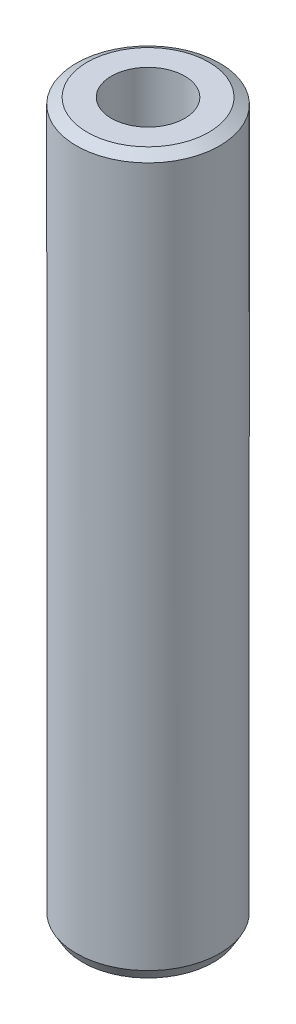
ISO-10303-21;
HEADER;
FILE_DESCRIPTION(('STEP AP214'),'2;1');
FILE_NAME('part.step','',(''),(''),'','','');
FILE_SCHEMA(('AUTOMOTIVE_DESIGN { 1 0 10303 214 1 1 1 1 }'));
ENDSEC;
DATA;
#1=APPLICATION_CONTEXT('core data for automotive mechanical design processes');
#2=APPLICATION_PROTOCOL_DEFINITION('international standard','automotive_design',2000,#1);
#3=PRODUCT_CONTEXT('',#1,'mechanical');
#4=PRODUCT('Part','Part','',(#3));
#5=PRODUCT_RELATED_PRODUCT_CATEGORY('part','',(#4));
#6=PRODUCT_DEFINITION_FORMATION('','',#4);
#7=PRODUCT_DEFINITION_CONTEXT('part definition',#1,'design');
#8=PRODUCT_DEFINITION('design','',#6,#7);
#9=PRODUCT_DEFINITION_SHAPE('','',#8);
#10=(LENGTH_UNIT() NAMED_UNIT(*) SI_UNIT(.MILLI.,.METRE.));
#11=(NAMED_UNIT(*) PLANE_ANGLE_UNIT() SI_UNIT($,.RADIAN.));
#12=(NAMED_UNIT(*) SI_UNIT($,.STERADIAN.) SOLID_ANGLE_UNIT());
#13=UNCERTAINTY_MEASURE_WITH_UNIT(LENGTH_MEASURE(1.E-05),#10,'distance_accuracy_value','');
#14=(GEOMETRIC_REPRESENTATION_CONTEXT(3) GLOBAL_UNCERTAINTY_ASSIGNED_CONTEXT((#13)) GLOBAL_UNIT_ASSIGNED_CONTEXT((#10,
#11,#12)) REPRESENTATION_CONTEXT('',''));
#15=CARTESIAN_POINT('',(0.,0.,0.));
#16=DIRECTION('',(0.,0.,1.));
#17=DIRECTION('',(1.,0.,0.));
#18=AXIS2_PLACEMENT_3D('',#15,#16,#17);
#19=CARTESIAN_POINT('',(0.,600.,0.));
#20=DIRECTION('',(0.,-1.,0.));
#21=DIRECTION('',(0.,0.,-1.));
#22=AXIS2_PLACEMENT_3D('',#19,#20,#21);
#23=CYLINDRICAL_SURFACE('',#22,60.);
#24=CARTESIAN_POINT('',(0.,594.753850427031,0.));
#25=DIRECTION('',(0.,1.,0.));
#26=DIRECTION('',(0.,0.,1.));
#27=AXIS2_PLACEMENT_3D('',#24,#25,#26);
#28=CIRCLE('',#27,60.);
#29=CARTESIAN_POINT('',(0.,594.753850427031,-60.0000000000001));
#30=VERTEX_POINT('',#29);
#31=EDGE_CURVE('E50',#30,#30,#28,.F.);
#32=ORIENTED_EDGE('',*,*,#31,.T.);
#33=EDGE_LOOP('',(#32));
#34=FACE_BOUND('',#33,.T.);
#35=CARTESIAN_POINT('',(0.,9.08659760448893,0.));
#36=DIRECTION('',(0.,1.,0.));
#37=DIRECTION('',(0.,0.,1.));
#38=AXIS2_PLACEMENT_3D('',#35,#36,#37);
#39=CIRCLE('',#38,60.);
#40=CARTESIAN_POINT('',(0.,9.08659760448893,60.));
#41=VERTEX_POINT('',#40);
#42=EDGE_CURVE('E51',#41,#41,#39,.T.);
#43=ORIENTED_EDGE('',*,*,#42,.T.);
#44=EDGE_LOOP('',(#43));
#45=FACE_BOUND('',#44,.T.);
#46=ADVANCED_FACE('F39',(#34,#45),#23,.T.);
#47=CARTESIAN_POINT('',(0.,600.,0.));
#48=DIRECTION('',(0.,1.,0.));
#49=DIRECTION('',(0.,0.,1.));
#50=AXIS2_PLACEMENT_3D('',#47,#48,#49);
#51=PLANE('',#50);
#52=CARTESIAN_POINT('',(0.,600.,0.));
#53=DIRECTION('',(0.,1.,0.));
#54=DIRECTION('',(0.,0.,1.));
#55=AXIS2_PLACEMENT_3D('',#52,#53,#54);
#56=CIRCLE('',#55,50.9134023955113);
#57=CARTESIAN_POINT('',(0.,600.,-50.9134023955114));
#58=VERTEX_POINT('',#57);
#59=EDGE_CURVE('E54',#58,#58,#56,.T.);
#60=ORIENTED_EDGE('',*,*,#59,.T.);
#61=EDGE_LOOP('',(#60));
#62=FACE_BOUND('',#61,.T.);
#63=CARTESIAN_POINT('',(0.,600.,0.));
#64=DIRECTION('',(0.,1.,0.));
#65=DIRECTION('',(0.,0.,1.));
#66=AXIS2_PLACEMENT_3D('',#63,#64,#65);
#67=CIRCLE('',#66,30.6929380186561);
#68=CARTESIAN_POINT('',(0.,600.,30.6929380186561));
#69=VERTEX_POINT('',#68);
#70=EDGE_CURVE('E58',#69,#69,#67,.T.);
#71=ORIENTED_EDGE('',*,*,#70,.F.);
#72=EDGE_LOOP('',(#71));
#73=FACE_BOUND('',#72,.T.);
#74=ADVANCED_FACE('F69',(#62,#73),#51,.T.);
#75=CARTESIAN_POINT('',(0.,0.,0.));
#76=DIRECTION('',(0.,1.,0.));
#77=DIRECTION('',(0.,0.,1.));
#78=AXIS2_PLACEMENT_3D('',#75,#76,#77);
#79=PLANE('',#78);
#80=CARTESIAN_POINT('',(0.,0.,0.));
#81=DIRECTION('',(0.,1.,0.));
#82=DIRECTION('',(0.,0.,1.));
#83=AXIS2_PLACEMENT_3D('',#80,#81,#82);
#84=CIRCLE('',#83,54.7538504270304);
#85=CARTESIAN_POINT('',(0.,0.,54.7538504270304));
#86=VERTEX_POINT('',#85);
#87=EDGE_CURVE('E10',#86,#86,#84,.F.);
#88=ORIENTED_EDGE('',*,*,#87,.T.);
#89=EDGE_LOOP('',(#88));
#90=FACE_BOUND('',#89,.T.);
#91=CARTESIAN_POINT('',(0.,0.,0.));
#92=DIRECTION('',(0.,1.,0.));
#93=DIRECTION('',(0.,0.,1.));
#94=AXIS2_PLACEMENT_3D('',#91,#92,#93);
#95=CIRCLE('',#94,30.6929380186561);
#96=CARTESIAN_POINT('',(0.,0.,30.6929380186561));
#97=VERTEX_POINT('',#96);
#98=EDGE_CURVE('E63',#97,#97,#95,.T.);
#99=ORIENTED_EDGE('',*,*,#98,.T.);
#100=EDGE_LOOP('',(#99));
#101=FACE_BOUND('',#100,.T.);
#102=ADVANCED_FACE('F75',(#90,#101),#79,.F.);
#103=CARTESIAN_POINT('',(0.,600.,0.));
#104=DIRECTION('',(0.,-1.,0.));
#105=DIRECTION('',(0.,0.,-1.));
#106=AXIS2_PLACEMENT_3D('',#103,#104,#105);
#107=CYLINDRICAL_SURFACE('',#106,30.6929380186561);
#108=ORIENTED_EDGE('',*,*,#70,.T.);
#109=EDGE_LOOP('',(#108));
#110=FACE_BOUND('',#109,.T.);
#111=ORIENTED_EDGE('',*,*,#98,.F.);
#112=EDGE_LOOP('',(#111));
#113=FACE_BOUND('',#112,.T.);
#114=ADVANCED_FACE('F70',(#110,#113),#107,.F.);
#115=CARTESIAN_POINT('',(0.,600.,0.));
#116=DIRECTION('',(0.,-1.,0.));
#117=DIRECTION('',(0.,0.,-1.));
#118=AXIS2_PLACEMENT_3D('',#115,#116,#117);
#119=CONICAL_SURFACE('',#118,50.9134023955113,1.04719755119659);
#120=CARTESIAN_POINT('',(0.,594.753850427031,-60.0000000000001));
#121=CARTESIAN_POINT('',(0.,594.808497818416,-59.90534794162));
#122=CARTESIAN_POINT('',(0.,594.863145209801,-59.8106958832399));
#123=CARTESIAN_POINT('',(0.,594.972439992571,-59.6213917664797));
#124=CARTESIAN_POINT('',(0.,595.027087383956,-59.5267397080996));
#125=CARTESIAN_POINT('',(0.,595.136382166726,-59.3374355913395));
#126=CARTESIAN_POINT('',(0.,595.191029558111,-59.2427835329594));
#127=CARTESIAN_POINT('',(0.,595.300324340881,-59.0534794161992));
#128=CARTESIAN_POINT('',(0.,595.354971732267,-58.9588273578191));
#129=CARTESIAN_POINT('',(0.,595.464266515037,-58.7695232410589));
#130=CARTESIAN_POINT('',(0.,595.518913906422,-58.6748711826788));
#131=CARTESIAN_POINT('',(0.,595.628208689192,-58.4855670659186));
#132=CARTESIAN_POINT('',(0.,595.682856080577,-58.3909150075386));
#133=CARTESIAN_POINT('',(0.,595.792150863347,-58.2016108907784));
#134=CARTESIAN_POINT('',(0.,595.846798254733,-58.1069588323983));
#135=CARTESIAN_POINT('',(0.,595.956093037503,-57.9176547156381));
#136=CARTESIAN_POINT('',(0.,596.010740428888,-57.823002657258));
#137=CARTESIAN_POINT('',(0.,596.120035211658,-57.6336985404978));
#138=CARTESIAN_POINT('',(0.,596.174682603043,-57.5390464821178));
#139=CARTESIAN_POINT('',(0.,596.283977385813,-57.3497423653576));
#140=CARTESIAN_POINT('',(0.,596.338624777198,-57.2550903069775));
#141=CARTESIAN_POINT('',(0.,596.447919559969,-57.0657861902173));
#142=CARTESIAN_POINT('',(0.,596.502566951354,-56.9711341318372));
#143=CARTESIAN_POINT('',(0.,596.611861734124,-56.781830015077));
#144=CARTESIAN_POINT('',(0.,596.666509125509,-56.6871779566969));
#145=CARTESIAN_POINT('',(0.,596.775803908279,-56.4978738399368));
#146=CARTESIAN_POINT('',(0.,596.830451299664,-56.4032217815567));
#147=CARTESIAN_POINT('',(0.,596.939746082434,-56.2139176647965));
#148=CARTESIAN_POINT('',(0.,596.99439347382,-56.1192656064164));
#149=CARTESIAN_POINT('',(0.,597.10368825659,-55.9299614896562));
#150=CARTESIAN_POINT('',(0.,597.158335647975,-55.8353094312761));
#151=CARTESIAN_POINT('',(0.,597.267630430745,-55.6460053145159));
#152=CARTESIAN_POINT('',(0.,597.32227782213,-55.5513532561359));
#153=CARTESIAN_POINT('',(0.,597.4315726049,-55.3620491393757));
#154=CARTESIAN_POINT('',(0.,597.486219996286,-55.2673970809956));
#155=CARTESIAN_POINT('',(0.,597.595514779056,-55.0780929642354));
#156=CARTESIAN_POINT('',(0.,597.650162170441,-54.9834409058553));
#157=CARTESIAN_POINT('',(0.,597.759456953211,-54.7941367890951));
#158=CARTESIAN_POINT('',(0.,597.814104344596,-54.699484730715));
#159=CARTESIAN_POINT('',(0.,597.923399127366,-54.5101806139549));
#160=CARTESIAN_POINT('',(0.,597.978046518751,-54.4155285555748));
#161=CARTESIAN_POINT('',(0.,598.087341301521,-54.2262244388146));
#162=CARTESIAN_POINT('',(0.,598.141988692907,-54.1315723804345));
#163=CARTESIAN_POINT('',(0.,598.251283475677,-53.9422682636743));
#164=CARTESIAN_POINT('',(0.,598.305930867062,-53.8476162052942));
#165=CARTESIAN_POINT('',(0.,598.415225649832,-53.6583120885341));
#166=CARTESIAN_POINT('',(0.,598.469873041217,-53.563660030154));
#167=CARTESIAN_POINT('',(0.,598.579167823987,-53.3743559133938));
#168=CARTESIAN_POINT('',(0.,598.633815215372,-53.2797038550137));
#169=CARTESIAN_POINT('',(0.,598.743109998143,-53.0903997382535));
#170=CARTESIAN_POINT('',(0.,598.797757389528,-52.9957476798734));
#171=CARTESIAN_POINT('',(0.,598.907052172298,-52.8064435631132));
#172=CARTESIAN_POINT('',(0.,598.961699563683,-52.7117915047331));
#173=CARTESIAN_POINT('',(0.,599.070994346453,-52.522487387973));
#174=CARTESIAN_POINT('',(0.,599.125641737838,-52.4278353295929));
#175=CARTESIAN_POINT('',(0.,599.234936520609,-52.2385312128327));
#176=CARTESIAN_POINT('',(0.,599.289583911994,-52.1438791544526));
#177=CARTESIAN_POINT('',(0.,599.398878694764,-51.9545750376924));
#178=CARTESIAN_POINT('',(0.,599.453526086149,-51.8599229793123));
#179=CARTESIAN_POINT('',(0.,599.562820868919,-51.6706188625522));
#180=CARTESIAN_POINT('',(0.,599.617468260304,-51.5759668041721));
#181=CARTESIAN_POINT('',(0.,599.726763043074,-51.3866626874119));
#182=CARTESIAN_POINT('',(0.,599.78141043446,-51.2920106290318));
#183=CARTESIAN_POINT('',(0.,599.89070521723,-51.1027065122716));
#184=CARTESIAN_POINT('',(0.,599.945352608615,-51.0080544538915));
#185=CARTESIAN_POINT('',(0.,600.,-50.9134023955114));
#186=B_SPLINE_CURVE_WITH_KNOTS('',3,(#120,#121,#122,#123,#124,#125,#126,#127,#128,#129,#130,
#131,#132,#133,#134,#135,#136,#137,#138,#139,#140,#141,#142,#143,#144,#145,#146,#147,#148,#149,
#150,#151,#152,#153,#154,#155,#156,#157,#158,#159,#160,#161,#162,#163,#164,#165,#166,#167,#168,
#169,#170,#171,#172,#173,#174,#175,#176,#177,#178,#179,#180,#181,#182,#183,#184,#185),
.UNSPECIFIED.,.F.,.F.,(4,2,2,2,2,2,2,2,2,2,2,2,2,2,2,2,2,2,2,2,2,2,2,2,2,2,2,2,2,2,2,2,4),(0.,
0.327884348310576,0.655768696621152,0.983653044931722,1.3115373932423,1.63942174155287,
1.9673060898635,2.29519043817407,2.62307478648465,2.95095913479523,3.2788434831058,
3.60672783141643,3.934612179727,4.26249652803758,4.59038087634816,4.91826522465873,
5.24614957296936,5.57403392127993,5.90191826959051,6.22980261790108,6.55768696621166,
6.88557131452223,7.21345566283286,7.54134001114343,7.86922435945401,8.19710870776459,
8.52499305607516,8.85287740438579,9.18076175269636,9.50864610100694,9.83653044931751,
10.1644147976281,10.4922991459387),.UNSPECIFIED.);
#187=EDGE_CURVE('BSEAM81',#30,#58,#186,.T.);
#188=ORIENTED_EDGE('',*,*,#31,.F.);
#189=ORIENTED_EDGE('',*,*,#59,.F.);
#190=ORIENTED_EDGE('',*,*,#187,.T.);
#191=ORIENTED_EDGE('',*,*,#187,.F.);
#192=EDGE_LOOP('',(#188,#190,#189,#191));
#193=FACE_BOUND('',#192,.T.);
#194=ADVANCED_FACE('F81',(#193),#119,.T.);
#195=CARTESIAN_POINT('',(0.,9.08659760448893,0.));
#196=DIRECTION('',(0.,1.,0.));
#197=DIRECTION('',(0.,0.,1.));
#198=AXIS2_PLACEMENT_3D('',#195,#196,#197);
#199=CONICAL_SURFACE('',#198,60.,0.523598775598307);
#200=ORIENTED_EDGE('',*,*,#87,.F.);
#201=EDGE_LOOP('',(#200));
#202=FACE_BOUND('',#201,.T.);
#203=ORIENTED_EDGE('',*,*,#42,.F.);
#204=EDGE_LOOP('',(#203));
#205=FACE_BOUND('',#204,.T.);
#206=ADVANCED_FACE('F45',(#202,#205),#199,.T.);
#207=CLOSED_SHELL('',(#46,#74,#102,#114,#194,#206));
#208=MANIFOLD_SOLID_BREP('B2',#207);
#209=ADVANCED_BREP_SHAPE_REPRESENTATION('',(#18,#208),#14);
#210=SHAPE_DEFINITION_REPRESENTATION(#9,#209);
ENDSEC;
END-ISO-10303-21;
